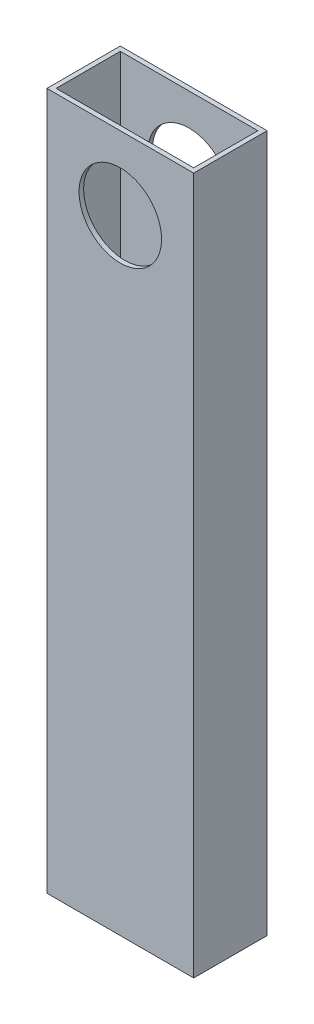
ISO-10303-21;
HEADER;
FILE_DESCRIPTION(('STEP AP214'),'2;1');
FILE_NAME('part.step','',(''),(''),'','','');
FILE_SCHEMA(('AUTOMOTIVE_DESIGN { 1 0 10303 214 1 1 1 1 }'));
ENDSEC;
DATA;
#1=APPLICATION_CONTEXT('core data for automotive mechanical design processes');
#2=APPLICATION_PROTOCOL_DEFINITION('international standard','automotive_design',2000,#1);
#3=PRODUCT_CONTEXT('',#1,'mechanical');
#4=PRODUCT('Part','Part','',(#3));
#5=PRODUCT_RELATED_PRODUCT_CATEGORY('part','',(#4));
#6=PRODUCT_DEFINITION_FORMATION('','',#4);
#7=PRODUCT_DEFINITION_CONTEXT('part definition',#1,'design');
#8=PRODUCT_DEFINITION('design','',#6,#7);
#9=PRODUCT_DEFINITION_SHAPE('','',#8);
#10=(LENGTH_UNIT() NAMED_UNIT(*) SI_UNIT(.MILLI.,.METRE.));
#11=(NAMED_UNIT(*) PLANE_ANGLE_UNIT() SI_UNIT($,.RADIAN.));
#12=(NAMED_UNIT(*) SI_UNIT($,.STERADIAN.) SOLID_ANGLE_UNIT());
#13=UNCERTAINTY_MEASURE_WITH_UNIT(LENGTH_MEASURE(1.E-05),#10,'distance_accuracy_value','');
#14=(GEOMETRIC_REPRESENTATION_CONTEXT(3) GLOBAL_UNCERTAINTY_ASSIGNED_CONTEXT((#13)) GLOBAL_UNIT_ASSIGNED_CONTEXT((#10,
#11,#12)) REPRESENTATION_CONTEXT('',''));
#15=CARTESIAN_POINT('',(0.,0.,0.));
#16=DIRECTION('',(0.,0.,1.));
#17=DIRECTION('',(1.,0.,0.));
#18=AXIS2_PLACEMENT_3D('',#15,#16,#17);
#19=CARTESIAN_POINT('',(0.,241.3,0.));
#20=DIRECTION('',(0.,1.,0.));
#21=DIRECTION('',(0.,0.,1.));
#22=AXIS2_PLACEMENT_3D('',#19,#20,#21);
#23=PLANE('',#22);
#24=DIRECTION('',(0.,0.,1.));
#25=VECTOR('',#24,1.);
#26=CARTESIAN_POINT('',(-15.24,241.3,-5.04824999999999));
#27=LINE('',#26,#25);
#28=CARTESIAN_POINT('',(-15.24,241.3,-5.04824999999999));
#29=VERTEX_POINT('',#28);
#30=CARTESIAN_POINT('',(-15.24,241.3,20.35175));
#31=VERTEX_POINT('',#30);
#32=EDGE_CURVE('E155',#29,#31,#27,.T.);
#33=ORIENTED_EDGE('',*,*,#32,.T.);
#34=DIRECTION('',(1.,0.,0.));
#35=VECTOR('',#34,1.);
#36=CARTESIAN_POINT('',(-15.24,241.3,20.35175));
#37=LINE('',#36,#35);
#38=CARTESIAN_POINT('',(35.56,241.3,20.35175));
#39=VERTEX_POINT('',#38);
#40=EDGE_CURVE('E159',#31,#39,#37,.T.);
#41=ORIENTED_EDGE('',*,*,#40,.T.);
#42=DIRECTION('',(0.,0.,-1.));
#43=VECTOR('',#42,1.);
#44=CARTESIAN_POINT('',(35.56,241.3,-5.04824999999999));
#45=LINE('',#44,#43);
#46=CARTESIAN_POINT('',(35.56,241.3,-5.04824999999999));
#47=VERTEX_POINT('',#46);
#48=EDGE_CURVE('E163',#39,#47,#45,.T.);
#49=ORIENTED_EDGE('',*,*,#48,.T.);
#50=DIRECTION('',(-1.,0.,0.));
#51=VECTOR('',#50,1.);
#52=CARTESIAN_POINT('',(-15.24,241.3,-5.04824999999999));
#53=LINE('',#52,#51);
#54=EDGE_CURVE('E166',#47,#29,#53,.T.);
#55=ORIENTED_EDGE('',*,*,#54,.T.);
#56=EDGE_LOOP('',(#33,#41,#49,#55));
#57=FACE_BOUND('',#56,.T.);
#58=DIRECTION('',(1.,0.,0.));
#59=VECTOR('',#58,1.);
#60=CARTESIAN_POINT('',(-13.6525,241.3,18.76425));
#61=LINE('',#60,#59);
#62=CARTESIAN_POINT('',(-13.6525,241.3,18.76425));
#63=VERTEX_POINT('',#62);
#64=CARTESIAN_POINT('',(33.9725,241.3,18.76425));
#65=VERTEX_POINT('',#64);
#66=EDGE_CURVE('E114',#63,#65,#61,.T.);
#67=ORIENTED_EDGE('',*,*,#66,.F.);
#68=DIRECTION('',(0.,0.,1.));
#69=VECTOR('',#68,1.);
#70=CARTESIAN_POINT('',(-13.6525,241.3,-3.46074999999999));
#71=LINE('',#70,#69);
#72=CARTESIAN_POINT('',(-13.6525,241.3,-3.46074999999999));
#73=VERTEX_POINT('',#72);
#74=EDGE_CURVE('E105',#73,#63,#71,.T.);
#75=ORIENTED_EDGE('',*,*,#74,.F.);
#76=DIRECTION('',(-1.,0.,0.));
#77=VECTOR('',#76,1.);
#78=CARTESIAN_POINT('',(-13.6525,241.3,-3.46074999999999));
#79=LINE('',#78,#77);
#80=CARTESIAN_POINT('',(33.9725,241.3,-3.46074999999999));
#81=VERTEX_POINT('',#80);
#82=EDGE_CURVE('E131',#81,#73,#79,.T.);
#83=ORIENTED_EDGE('',*,*,#82,.F.);
#84=DIRECTION('',(0.,0.,-1.));
#85=VECTOR('',#84,1.);
#86=CARTESIAN_POINT('',(33.9725,241.3,-3.46074999999999));
#87=LINE('',#86,#85);
#88=EDGE_CURVE('E127',#65,#81,#87,.T.);
#89=ORIENTED_EDGE('',*,*,#88,.F.);
#90=EDGE_LOOP('',(#67,#75,#83,#89));
#91=FACE_BOUND('',#90,.T.);
#92=ADVANCED_FACE('F38',(#57,#91),#23,.T.);
#93=CARTESIAN_POINT('',(0.,0.,0.));
#94=DIRECTION('',(0.,1.,0.));
#95=DIRECTION('',(0.,0.,1.));
#96=AXIS2_PLACEMENT_3D('',#93,#94,#95);
#97=PLANE('',#96);
#98=DIRECTION('',(0.,0.,1.));
#99=VECTOR('',#98,1.);
#100=CARTESIAN_POINT('',(-15.24,0.,-5.04824999999999));
#101=LINE('',#100,#99);
#102=CARTESIAN_POINT('',(-15.24,0.,-5.04824999999999));
#103=VERTEX_POINT('',#102);
#104=CARTESIAN_POINT('',(-15.24,0.,20.35175));
#105=VERTEX_POINT('',#104);
#106=EDGE_CURVE('E123',#103,#105,#101,.T.);
#107=ORIENTED_EDGE('',*,*,#106,.F.);
#108=DIRECTION('',(-1.,0.,0.));
#109=VECTOR('',#108,1.);
#110=CARTESIAN_POINT('',(-15.24,0.,-5.04824999999999));
#111=LINE('',#110,#109);
#112=CARTESIAN_POINT('',(35.56,0.,-5.04824999999999));
#113=VERTEX_POINT('',#112);
#114=EDGE_CURVE('E160',#113,#103,#111,.T.);
#115=ORIENTED_EDGE('',*,*,#114,.F.);
#116=DIRECTION('',(0.,0.,-1.));
#117=VECTOR('',#116,1.);
#118=CARTESIAN_POINT('',(35.56,0.,-5.04824999999999));
#119=LINE('',#118,#117);
#120=CARTESIAN_POINT('',(35.56,0.,20.35175));
#121=VERTEX_POINT('',#120);
#122=EDGE_CURVE('E176',#121,#113,#119,.T.);
#123=ORIENTED_EDGE('',*,*,#122,.F.);
#124=DIRECTION('',(1.,0.,0.));
#125=VECTOR('',#124,1.);
#126=CARTESIAN_POINT('',(-15.24,0.,20.35175));
#127=LINE('',#126,#125);
#128=EDGE_CURVE('E173',#105,#121,#127,.T.);
#129=ORIENTED_EDGE('',*,*,#128,.F.);
#130=EDGE_LOOP('',(#107,#115,#123,#129));
#131=FACE_BOUND('',#130,.T.);
#132=DIRECTION('',(0.,0.,1.));
#133=VECTOR('',#132,1.);
#134=CARTESIAN_POINT('',(-13.6525,0.,-3.46074999999999));
#135=LINE('',#134,#133);
#136=CARTESIAN_POINT('',(-13.6525,0.,-3.46074999999999));
#137=VERTEX_POINT('',#136);
#138=CARTESIAN_POINT('',(-13.6525,0.,18.76425));
#139=VERTEX_POINT('',#138);
#140=EDGE_CURVE('E63',#137,#139,#135,.T.);
#141=ORIENTED_EDGE('',*,*,#140,.T.);
#142=DIRECTION('',(1.,0.,0.));
#143=VECTOR('',#142,1.);
#144=CARTESIAN_POINT('',(-13.6525,0.,18.76425));
#145=LINE('',#144,#143);
#146=CARTESIAN_POINT('',(33.9725,0.,18.76425));
#147=VERTEX_POINT('',#146);
#148=EDGE_CURVE('E121',#139,#147,#145,.T.);
#149=ORIENTED_EDGE('',*,*,#148,.T.);
#150=DIRECTION('',(0.,0.,-1.));
#151=VECTOR('',#150,1.);
#152=CARTESIAN_POINT('',(33.9725,0.,-3.46074999999999));
#153=LINE('',#152,#151);
#154=CARTESIAN_POINT('',(33.9725,0.,-3.46074999999999));
#155=VERTEX_POINT('',#154);
#156=EDGE_CURVE('E142',#147,#155,#153,.T.);
#157=ORIENTED_EDGE('',*,*,#156,.T.);
#158=DIRECTION('',(-1.,0.,0.));
#159=VECTOR('',#158,1.);
#160=CARTESIAN_POINT('',(-13.6525,0.,-3.46074999999999));
#161=LINE('',#160,#159);
#162=EDGE_CURVE('E115',#155,#137,#161,.T.);
#163=ORIENTED_EDGE('',*,*,#162,.T.);
#164=EDGE_LOOP('',(#141,#149,#157,#163));
#165=FACE_BOUND('',#164,.T.);
#166=ADVANCED_FACE('F200',(#131,#165),#97,.F.);
#167=CARTESIAN_POINT('',(-15.24,241.3,-5.04824999999999));
#168=DIRECTION('',(1.,0.,0.));
#169=DIRECTION('',(0.,0.,-1.));
#170=AXIS2_PLACEMENT_3D('',#167,#168,#169);
#171=PLANE('',#170);
#172=ORIENTED_EDGE('',*,*,#106,.T.);
#173=DIRECTION('',(0.,-1.,0.));
#174=VECTOR('',#173,1.);
#175=CARTESIAN_POINT('',(-15.24,241.3,20.35175));
#176=LINE('',#175,#174);
#177=EDGE_CURVE('E11',#31,#105,#176,.T.);
#178=ORIENTED_EDGE('',*,*,#177,.F.);
#179=ORIENTED_EDGE('',*,*,#32,.F.);
#180=DIRECTION('',(0.,-1.,0.));
#181=VECTOR('',#180,1.);
#182=CARTESIAN_POINT('',(-15.24,241.3,-5.04824999999999));
#183=LINE('',#182,#181);
#184=EDGE_CURVE('E169',#29,#103,#183,.T.);
#185=ORIENTED_EDGE('',*,*,#184,.T.);
#186=EDGE_LOOP('',(#172,#178,#179,#185));
#187=FACE_BOUND('',#186,.T.);
#188=ADVANCED_FACE('F40',(#187),#171,.F.);
#189=CARTESIAN_POINT('',(-15.24,241.3,20.35175));
#190=DIRECTION('',(0.,0.,-1.));
#191=DIRECTION('',(-1.,0.,0.));
#192=AXIS2_PLACEMENT_3D('',#189,#190,#191);
#193=PLANE('',#192);
#194=CARTESIAN_POINT('',(10.16,215.9,20.35175));
#195=DIRECTION('',(0.,0.,-1.));
#196=DIRECTION('',(-1.,0.,0.));
#197=AXIS2_PLACEMENT_3D('',#194,#195,#196);
#198=CIRCLE('',#197,14.2881145641147);
#199=CARTESIAN_POINT('',(-4.12811456411464,215.9,20.35175));
#200=VERTEX_POINT('',#199);
#201=EDGE_CURVE('E240',#200,#200,#198,.T.);
#202=ORIENTED_EDGE('',*,*,#201,.T.);
#203=EDGE_LOOP('',(#202));
#204=FACE_BOUND('',#203,.T.);
#205=ORIENTED_EDGE('',*,*,#128,.T.);
#206=DIRECTION('',(0.,-1.,0.));
#207=VECTOR('',#206,1.);
#208=CARTESIAN_POINT('',(35.56,241.3,20.35175));
#209=LINE('',#208,#207);
#210=EDGE_CURVE('E48',#39,#121,#209,.T.);
#211=ORIENTED_EDGE('',*,*,#210,.F.);
#212=ORIENTED_EDGE('',*,*,#40,.F.);
#213=ORIENTED_EDGE('',*,*,#177,.T.);
#214=EDGE_LOOP('',(#205,#211,#212,#213));
#215=FACE_BOUND('',#214,.T.);
#216=ADVANCED_FACE('F210',(#204,#215),#193,.F.);
#217=CARTESIAN_POINT('',(35.56,241.3,-5.04824999999999));
#218=DIRECTION('',(-1.,0.,0.));
#219=DIRECTION('',(0.,0.,1.));
#220=AXIS2_PLACEMENT_3D('',#217,#218,#219);
#221=PLANE('',#220);
#222=ORIENTED_EDGE('',*,*,#122,.T.);
#223=DIRECTION('',(0.,-1.,0.));
#224=VECTOR('',#223,1.);
#225=CARTESIAN_POINT('',(35.56,241.3,-5.04824999999999));
#226=LINE('',#225,#224);
#227=EDGE_CURVE('E184',#47,#113,#226,.T.);
#228=ORIENTED_EDGE('',*,*,#227,.F.);
#229=ORIENTED_EDGE('',*,*,#48,.F.);
#230=ORIENTED_EDGE('',*,*,#210,.T.);
#231=EDGE_LOOP('',(#222,#228,#229,#230));
#232=FACE_BOUND('',#231,.T.);
#233=ADVANCED_FACE('F194',(#232),#221,.F.);
#234=CARTESIAN_POINT('',(-15.24,241.3,-5.04824999999999));
#235=DIRECTION('',(0.,0.,1.));
#236=DIRECTION('',(1.,0.,0.));
#237=AXIS2_PLACEMENT_3D('',#234,#235,#236);
#238=PLANE('',#237);
#239=CARTESIAN_POINT('',(10.16,215.9,-5.04824999999999));
#240=DIRECTION('',(0.,0.,-1.));
#241=DIRECTION('',(-1.,0.,0.));
#242=AXIS2_PLACEMENT_3D('',#239,#240,#241);
#243=CIRCLE('',#242,14.2881145641147);
#244=CARTESIAN_POINT('',(-4.12811456411464,215.9,-5.04824999999999));
#245=VERTEX_POINT('',#244);
#246=EDGE_CURVE('E237',#245,#245,#243,.T.);
#247=ORIENTED_EDGE('',*,*,#246,.F.);
#248=EDGE_LOOP('',(#247));
#249=FACE_BOUND('',#248,.T.);
#250=ORIENTED_EDGE('',*,*,#114,.T.);
#251=ORIENTED_EDGE('',*,*,#184,.F.);
#252=ORIENTED_EDGE('',*,*,#54,.F.);
#253=ORIENTED_EDGE('',*,*,#227,.T.);
#254=EDGE_LOOP('',(#250,#251,#252,#253));
#255=FACE_BOUND('',#254,.T.);
#256=ADVANCED_FACE('F204',(#249,#255),#238,.F.);
#257=CARTESIAN_POINT('',(-13.6525,241.3,-3.46074999999999));
#258=DIRECTION('',(1.,0.,0.));
#259=DIRECTION('',(0.,0.,-1.));
#260=AXIS2_PLACEMENT_3D('',#257,#258,#259);
#261=PLANE('',#260);
#262=ORIENTED_EDGE('',*,*,#140,.F.);
#263=DIRECTION('',(0.,-1.,0.));
#264=VECTOR('',#263,1.);
#265=CARTESIAN_POINT('',(-13.6525,241.3,-3.46074999999999));
#266=LINE('',#265,#264);
#267=EDGE_CURVE('E109',#73,#137,#266,.T.);
#268=ORIENTED_EDGE('',*,*,#267,.F.);
#269=ORIENTED_EDGE('',*,*,#74,.T.);
#270=DIRECTION('',(0.,-1.,0.));
#271=VECTOR('',#270,1.);
#272=CARTESIAN_POINT('',(-13.6525,241.3,18.76425));
#273=LINE('',#272,#271);
#274=EDGE_CURVE('E108',#63,#139,#273,.T.);
#275=ORIENTED_EDGE('',*,*,#274,.T.);
#276=EDGE_LOOP('',(#262,#268,#269,#275));
#277=FACE_BOUND('',#276,.T.);
#278=ADVANCED_FACE('F107',(#277),#261,.T.);
#279=CARTESIAN_POINT('',(-13.6525,241.3,18.76425));
#280=DIRECTION('',(0.,0.,-1.));
#281=DIRECTION('',(-1.,0.,0.));
#282=AXIS2_PLACEMENT_3D('',#279,#280,#281);
#283=PLANE('',#282);
#284=CARTESIAN_POINT('',(10.16,215.9,18.76425));
#285=DIRECTION('',(0.,0.,-1.));
#286=DIRECTION('',(-1.,0.,0.));
#287=AXIS2_PLACEMENT_3D('',#284,#285,#286);
#288=CIRCLE('',#287,14.2881145641147);
#289=CARTESIAN_POINT('',(-4.12811456411464,215.9,18.76425));
#290=VERTEX_POINT('',#289);
#291=EDGE_CURVE('E139',#290,#290,#288,.T.);
#292=ORIENTED_EDGE('',*,*,#291,.F.);
#293=EDGE_LOOP('',(#292));
#294=FACE_BOUND('',#293,.T.);
#295=ORIENTED_EDGE('',*,*,#148,.F.);
#296=ORIENTED_EDGE('',*,*,#274,.F.);
#297=ORIENTED_EDGE('',*,*,#66,.T.);
#298=DIRECTION('',(0.,-1.,0.));
#299=VECTOR('',#298,1.);
#300=CARTESIAN_POINT('',(33.9725,241.3,18.76425));
#301=LINE('',#300,#299);
#302=EDGE_CURVE('E124',#65,#147,#301,.T.);
#303=ORIENTED_EDGE('',*,*,#302,.T.);
#304=EDGE_LOOP('',(#295,#296,#297,#303));
#305=FACE_BOUND('',#304,.T.);
#306=ADVANCED_FACE('F118',(#294,#305),#283,.T.);
#307=CARTESIAN_POINT('',(33.9725,241.3,-3.46074999999999));
#308=DIRECTION('',(-1.,0.,0.));
#309=DIRECTION('',(0.,0.,1.));
#310=AXIS2_PLACEMENT_3D('',#307,#308,#309);
#311=PLANE('',#310);
#312=ORIENTED_EDGE('',*,*,#156,.F.);
#313=ORIENTED_EDGE('',*,*,#302,.F.);
#314=ORIENTED_EDGE('',*,*,#88,.T.);
#315=DIRECTION('',(0.,-1.,0.));
#316=VECTOR('',#315,1.);
#317=CARTESIAN_POINT('',(33.9725,241.3,-3.46074999999999));
#318=LINE('',#317,#316);
#319=EDGE_CURVE('E55',#81,#155,#318,.T.);
#320=ORIENTED_EDGE('',*,*,#319,.T.);
#321=EDGE_LOOP('',(#312,#313,#314,#320));
#322=FACE_BOUND('',#321,.T.);
#323=ADVANCED_FACE('F256',(#322),#311,.T.);
#324=CARTESIAN_POINT('',(-13.6525,241.3,-3.46074999999999));
#325=DIRECTION('',(0.,0.,1.));
#326=DIRECTION('',(1.,0.,0.));
#327=AXIS2_PLACEMENT_3D('',#324,#325,#326);
#328=PLANE('',#327);
#329=CARTESIAN_POINT('',(10.16,215.9,-3.46075));
#330=DIRECTION('',(0.,0.,1.));
#331=DIRECTION('',(1.,0.,0.));
#332=AXIS2_PLACEMENT_3D('',#329,#330,#331);
#333=CIRCLE('',#332,14.2881145641147);
#334=CARTESIAN_POINT('',(24.4481145641147,215.9,-3.46075));
#335=VERTEX_POINT('',#334);
#336=EDGE_CURVE('E42',#335,#335,#333,.T.);
#337=ORIENTED_EDGE('',*,*,#336,.F.);
#338=EDGE_LOOP('',(#337));
#339=FACE_BOUND('',#338,.T.);
#340=ORIENTED_EDGE('',*,*,#162,.F.);
#341=ORIENTED_EDGE('',*,*,#319,.F.);
#342=ORIENTED_EDGE('',*,*,#82,.T.);
#343=ORIENTED_EDGE('',*,*,#267,.T.);
#344=EDGE_LOOP('',(#340,#341,#342,#343));
#345=FACE_BOUND('',#344,.T.);
#346=ADVANCED_FACE('F254',(#339,#345),#328,.T.);
#347=CARTESIAN_POINT('',(10.16,215.9,20.35175));
#348=DIRECTION('',(0.,0.,-1.));
#349=DIRECTION('',(-1.,0.,0.));
#350=AXIS2_PLACEMENT_3D('',#347,#348,#349);
#351=CYLINDRICAL_SURFACE('',#350,14.2881145641147);
#352=ORIENTED_EDGE('',*,*,#336,.T.);
#353=EDGE_LOOP('',(#352));
#354=FACE_BOUND('',#353,.T.);
#355=ORIENTED_EDGE('',*,*,#246,.T.);
#356=EDGE_LOOP('',(#355));
#357=FACE_BOUND('',#356,.T.);
#358=ADVANCED_FACE('F252',(#354,#357),#351,.F.);
#359=ORIENTED_EDGE('',*,*,#291,.T.);
#360=EDGE_LOOP('',(#359));
#361=FACE_BOUND('',#360,.T.);
#362=ORIENTED_EDGE('',*,*,#201,.F.);
#363=EDGE_LOOP('',(#362));
#364=FACE_BOUND('',#363,.T.);
#365=ADVANCED_FACE('F268',(#361,#364),#351,.F.);
#366=CLOSED_SHELL('',(#92,#166,#188,#216,#233,#256,#278,#306,#323,#346,#358,#365));
#367=MANIFOLD_SOLID_BREP('B2',#366);
#368=ADVANCED_BREP_SHAPE_REPRESENTATION('',(#18,#367),#14);
#369=SHAPE_DEFINITION_REPRESENTATION(#9,#368);
ENDSEC;
END-ISO-10303-21;
